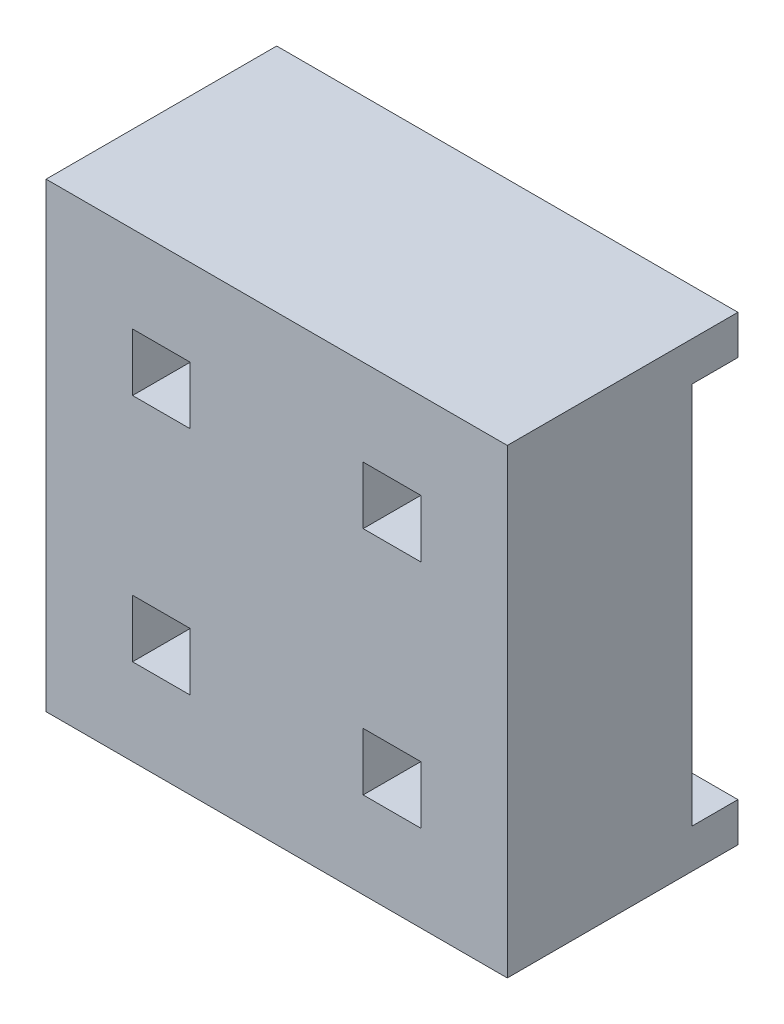
ISO-10303-21;
HEADER;
FILE_DESCRIPTION(('STEP AP214'),'2;1');
FILE_NAME('part.step','',(''),(''),'','','');
FILE_SCHEMA(('AUTOMOTIVE_DESIGN { 1 0 10303 214 1 1 1 1 }'));
ENDSEC;
DATA;
#1=APPLICATION_CONTEXT('core data for automotive mechanical design processes');
#2=APPLICATION_PROTOCOL_DEFINITION('international standard','automotive_design',2000,#1);
#3=PRODUCT_CONTEXT('',#1,'mechanical');
#4=PRODUCT('Part','Part','',(#3));
#5=PRODUCT_RELATED_PRODUCT_CATEGORY('part','',(#4));
#6=PRODUCT_DEFINITION_FORMATION('','',#4);
#7=PRODUCT_DEFINITION_CONTEXT('part definition',#1,'design');
#8=PRODUCT_DEFINITION('design','',#6,#7);
#9=PRODUCT_DEFINITION_SHAPE('','',#8);
#10=(LENGTH_UNIT() NAMED_UNIT(*) SI_UNIT(.MILLI.,.METRE.));
#11=(NAMED_UNIT(*) PLANE_ANGLE_UNIT() SI_UNIT($,.RADIAN.));
#12=(NAMED_UNIT(*) SI_UNIT($,.STERADIAN.) SOLID_ANGLE_UNIT());
#13=UNCERTAINTY_MEASURE_WITH_UNIT(LENGTH_MEASURE(1.E-05),#10,'distance_accuracy_value','');
#14=(GEOMETRIC_REPRESENTATION_CONTEXT(3) GLOBAL_UNCERTAINTY_ASSIGNED_CONTEXT((#13)) GLOBAL_UNIT_ASSIGNED_CONTEXT((#10,
#11,#12)) REPRESENTATION_CONTEXT('',''));
#15=CARTESIAN_POINT('',(0.,0.,0.));
#16=DIRECTION('',(0.,0.,1.));
#17=DIRECTION('',(1.,0.,0.));
#18=AXIS2_PLACEMENT_3D('',#15,#16,#17);
#19=CARTESIAN_POINT('',(0.000117822266474832,0.000124023441458121,1.25));
#20=DIRECTION('',(0.,-4.37113882867379E-08,1.));
#21=DIRECTION('',(0.,-1.,-4.37113882867379E-08));
#22=AXIS2_PLACEMENT_3D('',#19,#20,#21);
#23=PLANE('',#22);
#24=DIRECTION('',(0.,-0.999999999999999,-4.37113882735736E-08));
#25=VECTOR('',#24,1.);
#26=CARTESIAN_POINT('',(-2.53988217773352,-2.10807597655854,1.24999990784765));
#27=LINE('',#26,#25);
#28=CARTESIAN_POINT('',(-2.53988217773353,-2.10807597655854,1.24999990784765));
#29=VERTEX_POINT('',#28);
#30=CARTESIAN_POINT('',(-2.53988217773353,-2.53987597655854,1.24999988897307));
#31=VERTEX_POINT('',#30);
#32=EDGE_CURVE('E11',#29,#31,#27,.T.);
#33=ORIENTED_EDGE('',*,*,#32,.F.);
#34=DIRECTION('',(1.,0.,0.));
#35=VECTOR('',#34,1.);
#36=CARTESIAN_POINT('',(-2.53988217773353,-2.10807597655854,1.24999990784765));
#37=LINE('',#36,#35);
#38=CARTESIAN_POINT('',(2.54011782226648,-2.10807597655854,1.24999990784765));
#39=VERTEX_POINT('',#38);
#40=EDGE_CURVE('E323',#29,#39,#37,.T.);
#41=ORIENTED_EDGE('',*,*,#40,.T.);
#42=DIRECTION('',(0.,0.999999999999999,4.37113882735736E-08));
#43=VECTOR('',#42,1.);
#44=CARTESIAN_POINT('',(2.54011782226648,-2.53987597655854,1.24999988897307));
#45=LINE('',#44,#43);
#46=CARTESIAN_POINT('',(2.54011782226648,-2.53987597655854,1.24999988897307));
#47=VERTEX_POINT('',#46);
#48=EDGE_CURVE('E316',#47,#39,#45,.T.);
#49=ORIENTED_EDGE('',*,*,#48,.F.);
#50=DIRECTION('',(1.,0.,0.));
#51=VECTOR('',#50,1.);
#52=CARTESIAN_POINT('',(-2.53988217773353,-2.53987597655854,1.24999988897307));
#53=LINE('',#52,#51);
#54=EDGE_CURVE('E321',#31,#47,#53,.T.);
#55=ORIENTED_EDGE('',*,*,#54,.F.);
#56=EDGE_LOOP('',(#33,#41,#49,#55));
#57=FACE_BOUND('',#56,.T.);
#58=ADVANCED_FACE('F17',(#57),#23,.F.);
#59=CARTESIAN_POINT('',(-2.53988217773353,2.54012391241453,3.79000011102693));
#60=DIRECTION('',(1.,0.,0.));
#61=DIRECTION('',(0.,1.,4.37113882867379E-08));
#62=AXIS2_PLACEMENT_3D('',#59,#60,#61);
#63=PLANE('',#62);
#64=DIRECTION('',(0.,-0.999999999999999,-4.37113883231379E-08));
#65=VECTOR('',#64,1.);
#66=CARTESIAN_POINT('',(-2.53988217773353,2.10832400123607,1.75800009215235));
#67=LINE('',#66,#65);
#68=CARTESIAN_POINT('',(-2.53988217773353,2.10832400123607,1.75800009215235));
#69=VERTEX_POINT('',#68);
#70=CARTESIAN_POINT('',(-2.53988217773353,-2.10807599876393,1.75799990784765));
#71=VERTEX_POINT('',#70);
#72=EDGE_CURVE('E24',#69,#71,#67,.T.);
#73=ORIENTED_EDGE('',*,*,#72,.T.);
#74=DIRECTION('',(0.,4.37113888392268E-08,-0.999999999999999));
#75=VECTOR('',#74,1.);
#76=CARTESIAN_POINT('',(-2.53988217773353,-2.10807599876393,1.75799990784765));
#77=LINE('',#76,#75);
#78=EDGE_CURVE('E319',#71,#29,#77,.T.);
#79=ORIENTED_EDGE('',*,*,#78,.T.);
#80=ORIENTED_EDGE('',*,*,#32,.T.);
#81=DIRECTION('',(0.,4.3711388314712E-08,-0.999999999999999));
#82=VECTOR('',#81,1.);
#83=CARTESIAN_POINT('',(-2.53988217773353,-2.53987608758547,3.78999988897307));
#84=LINE('',#83,#82);
#85=CARTESIAN_POINT('',(-2.53988217773353,-2.53987608758547,3.78999988897307));
#86=VERTEX_POINT('',#85);
#87=EDGE_CURVE('E301',#86,#31,#84,.T.);
#88=ORIENTED_EDGE('',*,*,#87,.F.);
#89=DIRECTION('',(0.,-0.999999999999999,-4.37113884895503E-08));
#90=VECTOR('',#89,1.);
#91=CARTESIAN_POINT('',(-2.53988217773353,2.54012391241453,3.79000011102693));
#92=LINE('',#91,#90);
#93=CARTESIAN_POINT('',(-2.53988217773353,2.54012391241453,3.79000011102693));
#94=VERTEX_POINT('',#93);
#95=EDGE_CURVE('E289',#94,#86,#92,.T.);
#96=ORIENTED_EDGE('',*,*,#95,.F.);
#97=DIRECTION('',(0.,4.3711388314712E-08,-0.999999999999999));
#98=VECTOR('',#97,1.);
#99=CARTESIAN_POINT('',(-2.53988217773353,2.54012391241453,3.79000011102693));
#100=LINE('',#99,#98);
#101=CARTESIAN_POINT('',(-2.53988217773353,2.54012402344146,1.25000011102693));
#102=VERTEX_POINT('',#101);
#103=EDGE_CURVE('E276',#94,#102,#100,.T.);
#104=ORIENTED_EDGE('',*,*,#103,.T.);
#105=DIRECTION('',(0.,-0.999999999999999,-4.37113882735736E-08));
#106=VECTOR('',#105,1.);
#107=CARTESIAN_POINT('',(-2.53988217773353,2.54012402344146,1.25000011102693));
#108=LINE('',#107,#106);
#109=CARTESIAN_POINT('',(-2.53988217773353,2.10832402344146,1.25000009215235));
#110=VERTEX_POINT('',#109);
#111=EDGE_CURVE('E261',#102,#110,#108,.T.);
#112=ORIENTED_EDGE('',*,*,#111,.T.);
#113=DIRECTION('',(0.,-4.37113879650355E-08,0.999999999999999));
#114=VECTOR('',#113,1.);
#115=CARTESIAN_POINT('',(-2.53988217773353,2.10832402344146,1.25000009215235));
#116=LINE('',#115,#114);
#117=EDGE_CURVE('E247',#110,#69,#116,.T.);
#118=ORIENTED_EDGE('',*,*,#117,.T.);
#119=EDGE_LOOP('',(#73,#79,#80,#88,#96,#104,#112,#118));
#120=FACE_BOUND('',#119,.T.);
#121=ADVANCED_FACE('F416',(#120),#63,.F.);
#122=CARTESIAN_POINT('',(-2.53988217773353,-2.53987608758547,3.78999988897307));
#123=DIRECTION('',(0.,1.,4.37113882867379E-08));
#124=DIRECTION('',(-1.,0.,0.));
#125=AXIS2_PLACEMENT_3D('',#122,#123,#124);
#126=PLANE('',#125);
#127=ORIENTED_EDGE('',*,*,#54,.T.);
#128=DIRECTION('',(0.,4.3711388314712E-08,-0.999999999999999));
#129=VECTOR('',#128,1.);
#130=CARTESIAN_POINT('',(2.54011782226648,-2.53987608758547,3.78999988897307));
#131=LINE('',#130,#129);
#132=CARTESIAN_POINT('',(2.54011782226648,-2.53987608758547,3.78999988897307));
#133=VERTEX_POINT('',#132);
#134=EDGE_CURVE('E313',#133,#47,#131,.T.);
#135=ORIENTED_EDGE('',*,*,#134,.F.);
#136=DIRECTION('',(1.,0.,0.));
#137=VECTOR('',#136,1.);
#138=CARTESIAN_POINT('',(-2.53988217773353,-2.53987608758547,3.78999988897307));
#139=LINE('',#138,#137);
#140=EDGE_CURVE('E304',#86,#133,#139,.T.);
#141=ORIENTED_EDGE('',*,*,#140,.F.);
#142=ORIENTED_EDGE('',*,*,#87,.T.);
#143=EDGE_LOOP('',(#127,#135,#141,#142));
#144=FACE_BOUND('',#143,.T.);
#145=ADVANCED_FACE('F420',(#144),#126,.F.);
#146=CARTESIAN_POINT('',(2.54011782226648,-2.53987608758547,3.78999988897307));
#147=DIRECTION('',(-1.,0.,0.));
#148=DIRECTION('',(0.,-1.,-4.37113882867379E-08));
#149=AXIS2_PLACEMENT_3D('',#146,#147,#148);
#150=PLANE('',#149);
#151=ORIENTED_EDGE('',*,*,#48,.T.);
#152=DIRECTION('',(0.,4.37113888392268E-08,-0.999999999999999));
#153=VECTOR('',#152,1.);
#154=CARTESIAN_POINT('',(2.54011782226648,-2.10807599876393,1.75799990784765));
#155=LINE('',#154,#153);
#156=CARTESIAN_POINT('',(2.54011782226648,-2.10807599876393,1.75799990784765));
#157=VERTEX_POINT('',#156);
#158=EDGE_CURVE('E307',#157,#39,#155,.T.);
#159=ORIENTED_EDGE('',*,*,#158,.F.);
#160=DIRECTION('',(0.,-0.999999999999999,-4.37113883231379E-08));
#161=VECTOR('',#160,1.);
#162=CARTESIAN_POINT('',(2.54011782226648,2.10832400123607,1.75800009215235));
#163=LINE('',#162,#161);
#164=CARTESIAN_POINT('',(2.54011782226648,2.10832400123607,1.75800009215235));
#165=VERTEX_POINT('',#164);
#166=EDGE_CURVE('E292',#165,#157,#163,.T.);
#167=ORIENTED_EDGE('',*,*,#166,.F.);
#168=DIRECTION('',(0.,-4.37113879650355E-08,0.999999999999999));
#169=VECTOR('',#168,1.);
#170=CARTESIAN_POINT('',(2.54011782226648,2.10832402344146,1.25000009215235));
#171=LINE('',#170,#169);
#172=CARTESIAN_POINT('',(2.54011782226648,2.10832402344146,1.25000009215235));
#173=VERTEX_POINT('',#172);
#174=EDGE_CURVE('E278',#173,#165,#171,.T.);
#175=ORIENTED_EDGE('',*,*,#174,.F.);
#176=DIRECTION('',(0.,0.999999999999999,4.37113882735736E-08));
#177=VECTOR('',#176,1.);
#178=CARTESIAN_POINT('',(2.54011782226647,2.10832402344146,1.25000009215235));
#179=LINE('',#178,#177);
#180=CARTESIAN_POINT('',(2.54011782226648,2.54012402344146,1.25000011102693));
#181=VERTEX_POINT('',#180);
#182=EDGE_CURVE('E263',#173,#181,#179,.T.);
#183=ORIENTED_EDGE('',*,*,#182,.T.);
#184=DIRECTION('',(0.,4.3711388314712E-08,-0.999999999999999));
#185=VECTOR('',#184,1.);
#186=CARTESIAN_POINT('',(2.54011782226648,2.54012391241453,3.79000011102693));
#187=LINE('',#186,#185);
#188=CARTESIAN_POINT('',(2.54011782226648,2.54012391241453,3.79000011102693));
#189=VERTEX_POINT('',#188);
#190=EDGE_CURVE('E249',#189,#181,#187,.T.);
#191=ORIENTED_EDGE('',*,*,#190,.F.);
#192=DIRECTION('',(0.,0.999999999999999,4.37113881398737E-08));
#193=VECTOR('',#192,1.);
#194=CARTESIAN_POINT('',(2.54011782226648,-2.53987608758547,3.78999988897307));
#195=LINE('',#194,#193);
#196=EDGE_CURVE('E236',#133,#189,#195,.T.);
#197=ORIENTED_EDGE('',*,*,#196,.F.);
#198=ORIENTED_EDGE('',*,*,#134,.T.);
#199=EDGE_LOOP('',(#151,#159,#167,#175,#183,#191,#197,#198));
#200=FACE_BOUND('',#199,.T.);
#201=ADVANCED_FACE('F329',(#200),#150,.F.);
#202=CARTESIAN_POINT('',(0.952617822266475,1.58762391241453,3.79000006939183));
#203=DIRECTION('',(1.,0.,0.));
#204=DIRECTION('',(0.,1.,4.37113882867379E-08));
#205=AXIS2_PLACEMENT_3D('',#202,#203,#204);
#206=PLANE('',#205);
#207=DIRECTION('',(0.,-0.999999999999999,-4.3711388314712E-08));
#208=VECTOR('',#207,1.);
#209=CARTESIAN_POINT('',(0.952617822266475,1.58762400123607,1.75800006939183));
#210=LINE('',#209,#208);
#211=CARTESIAN_POINT('',(0.952617822266475,1.58762400123607,1.75800006939183));
#212=VERTEX_POINT('',#211);
#213=CARTESIAN_POINT('',(0.952617822266475,0.952624001236073,1.7580000416351));
#214=VERTEX_POINT('',#213);
#215=EDGE_CURVE('E310',#212,#214,#210,.T.);
#216=ORIENTED_EDGE('',*,*,#215,.F.);
#217=DIRECTION('',(0.,4.37113884021311E-08,-0.999999999999999));
#218=VECTOR('',#217,1.);
#219=CARTESIAN_POINT('',(0.952617822266475,1.58762391241453,3.79000006939183));
#220=LINE('',#219,#218);
#221=CARTESIAN_POINT('',(0.952617822266475,1.58762391241453,3.79000006939183));
#222=VERTEX_POINT('',#221);
#223=EDGE_CURVE('E295',#222,#212,#220,.T.);
#224=ORIENTED_EDGE('',*,*,#223,.F.);
#225=DIRECTION('',(0.,-0.999999999999999,-4.3711388314712E-08));
#226=VECTOR('',#225,1.);
#227=CARTESIAN_POINT('',(0.952617822266475,1.58762391241453,3.79000006939183));
#228=LINE('',#227,#226);
#229=CARTESIAN_POINT('',(0.952617822266475,0.952623912414532,3.7900000416351));
#230=VERTEX_POINT('',#229);
#231=EDGE_CURVE('E281',#222,#230,#228,.T.);
#232=ORIENTED_EDGE('',*,*,#231,.T.);
#233=DIRECTION('',(0.,4.37113882928572E-08,-0.999999999999999));
#234=VECTOR('',#233,1.);
#235=CARTESIAN_POINT('',(0.952617822266475,0.952623912414532,3.7900000416351));
#236=LINE('',#235,#234);
#237=EDGE_CURVE('E265',#230,#214,#236,.T.);
#238=ORIENTED_EDGE('',*,*,#237,.T.);
#239=EDGE_LOOP('',(#216,#224,#232,#238));
#240=FACE_BOUND('',#239,.T.);
#241=ADVANCED_FACE('F435',(#240),#206,.T.);
#242=CARTESIAN_POINT('',(1.58761782226647,1.58762391241453,3.79000006939183));
#243=DIRECTION('',(0.,-1.,-4.37113882867379E-08));
#244=DIRECTION('',(1.,0.,0.));
#245=AXIS2_PLACEMENT_3D('',#242,#243,#244);
#246=PLANE('',#245);
#247=DIRECTION('',(-1.,0.,0.));
#248=VECTOR('',#247,1.);
#249=CARTESIAN_POINT('',(1.58761782226647,1.58762400123607,1.75800006939183));
#250=LINE('',#249,#248);
#251=CARTESIAN_POINT('',(1.58761782226647,1.58762400123607,1.75800006939183));
#252=VERTEX_POINT('',#251);
#253=EDGE_CURVE('E298',#252,#212,#250,.T.);
#254=ORIENTED_EDGE('',*,*,#253,.F.);
#255=DIRECTION('',(0.,4.37113884021311E-08,-0.999999999999999));
#256=VECTOR('',#255,1.);
#257=CARTESIAN_POINT('',(1.58761782226647,1.58762391241453,3.79000006939183));
#258=LINE('',#257,#256);
#259=CARTESIAN_POINT('',(1.58761782226647,1.58762391241453,3.79000006939183));
#260=VERTEX_POINT('',#259);
#261=EDGE_CURVE('E283',#260,#252,#258,.T.);
#262=ORIENTED_EDGE('',*,*,#261,.F.);
#263=DIRECTION('',(-1.,0.,0.));
#264=VECTOR('',#263,1.);
#265=CARTESIAN_POINT('',(1.58761782226647,1.58762391241453,3.79000006939183));
#266=LINE('',#265,#264);
#267=EDGE_CURVE('E267',#260,#222,#266,.T.);
#268=ORIENTED_EDGE('',*,*,#267,.T.);
#269=ORIENTED_EDGE('',*,*,#223,.T.);
#270=EDGE_LOOP('',(#254,#262,#268,#269));
#271=FACE_BOUND('',#270,.T.);
#272=ADVANCED_FACE('F438',(#271),#246,.T.);
#273=CARTESIAN_POINT('',(1.58761782226647,0.952623912414532,3.7900000416351));
#274=DIRECTION('',(-1.,0.,0.));
#275=DIRECTION('',(0.,-1.,-4.37113882867379E-08));
#276=AXIS2_PLACEMENT_3D('',#273,#274,#275);
#277=PLANE('',#276);
#278=DIRECTION('',(0.,0.999999999999999,4.3711388314712E-08));
#279=VECTOR('',#278,1.);
#280=CARTESIAN_POINT('',(1.58761782226647,0.952624001236073,1.7580000416351));
#281=LINE('',#280,#279);
#282=CARTESIAN_POINT('',(1.58761782226647,0.952624001236073,1.7580000416351));
#283=VERTEX_POINT('',#282);
#284=EDGE_CURVE('E286',#283,#252,#281,.T.);
#285=ORIENTED_EDGE('',*,*,#284,.F.);
#286=DIRECTION('',(0.,4.37113882928572E-08,-0.999999999999999));
#287=VECTOR('',#286,1.);
#288=CARTESIAN_POINT('',(1.58761782226647,0.952623912414532,3.7900000416351));
#289=LINE('',#288,#287);
#290=CARTESIAN_POINT('',(1.58761782226647,0.952623912414532,3.7900000416351));
#291=VERTEX_POINT('',#290);
#292=EDGE_CURVE('E270',#291,#283,#289,.T.);
#293=ORIENTED_EDGE('',*,*,#292,.F.);
#294=DIRECTION('',(0.,0.999999999999999,4.3711388314712E-08));
#295=VECTOR('',#294,1.);
#296=CARTESIAN_POINT('',(1.58761782226647,0.952623912414532,3.7900000416351));
#297=LINE('',#296,#295);
#298=EDGE_CURVE('E252',#291,#260,#297,.T.);
#299=ORIENTED_EDGE('',*,*,#298,.T.);
#300=ORIENTED_EDGE('',*,*,#261,.T.);
#301=EDGE_LOOP('',(#285,#293,#299,#300));
#302=FACE_BOUND('',#301,.T.);
#303=ADVANCED_FACE('F442',(#302),#277,.T.);
#304=CARTESIAN_POINT('',(0.952617822266475,-0.952376087585468,3.7899999583649));
#305=DIRECTION('',(1.,0.,0.));
#306=DIRECTION('',(0.,1.,4.37113882867379E-08));
#307=AXIS2_PLACEMENT_3D('',#304,#305,#306);
#308=PLANE('',#307);
#309=DIRECTION('',(0.,-0.999999999999999,-4.3711388314712E-08));
#310=VECTOR('',#309,1.);
#311=CARTESIAN_POINT('',(0.952617822266475,-0.952375998763927,1.7579999583649));
#312=LINE('',#311,#310);
#313=CARTESIAN_POINT('',(0.952617822266475,-0.952375998763927,1.7579999583649));
#314=VERTEX_POINT('',#313);
#315=CARTESIAN_POINT('',(0.952617822266475,-1.58737599876393,1.75799993060817));
#316=VERTEX_POINT('',#315);
#317=EDGE_CURVE('E273',#314,#316,#312,.T.);
#318=ORIENTED_EDGE('',*,*,#317,.F.);
#319=DIRECTION('',(0.,4.37113882928572E-08,-0.999999999999999));
#320=VECTOR('',#319,1.);
#321=CARTESIAN_POINT('',(0.952617822266475,-0.952376087585468,3.7899999583649));
#322=LINE('',#321,#320);
#323=CARTESIAN_POINT('',(0.952617822266475,-0.952376087585468,3.7899999583649));
#324=VERTEX_POINT('',#323);
#325=EDGE_CURVE('E255',#324,#314,#322,.T.);
#326=ORIENTED_EDGE('',*,*,#325,.F.);
#327=DIRECTION('',(0.,-0.999999999999999,-4.3711388314712E-08));
#328=VECTOR('',#327,1.);
#329=CARTESIAN_POINT('',(0.952617822266475,-0.952376087585468,3.7899999583649));
#330=LINE('',#329,#328);
#331=CARTESIAN_POINT('',(0.952617822266475,-1.58737608758547,3.78999993060817));
#332=VERTEX_POINT('',#331);
#333=EDGE_CURVE('E239',#324,#332,#330,.T.);
#334=ORIENTED_EDGE('',*,*,#333,.T.);
#335=DIRECTION('',(0.,4.37113881835833E-08,-0.999999999999999));
#336=VECTOR('',#335,1.);
#337=CARTESIAN_POINT('',(0.952617822266475,-1.58737608758547,3.78999993060817));
#338=LINE('',#337,#336);
#339=EDGE_CURVE('E225',#332,#316,#338,.T.);
#340=ORIENTED_EDGE('',*,*,#339,.T.);
#341=EDGE_LOOP('',(#318,#326,#334,#340));
#342=FACE_BOUND('',#341,.T.);
#343=ADVANCED_FACE('F450',(#342),#308,.T.);
#344=CARTESIAN_POINT('',(1.58761782226647,-0.952376087585468,3.7899999583649));
#345=DIRECTION('',(0.,-1.,-4.37113882867379E-08));
#346=DIRECTION('',(1.,0.,0.));
#347=AXIS2_PLACEMENT_3D('',#344,#345,#346);
#348=PLANE('',#347);
#349=DIRECTION('',(-1.,0.,0.));
#350=VECTOR('',#349,1.);
#351=CARTESIAN_POINT('',(1.58761782226647,-0.952375998763927,1.7579999583649));
#352=LINE('',#351,#350);
#353=CARTESIAN_POINT('',(1.58761782226647,-0.952375998763927,1.7579999583649));
#354=VERTEX_POINT('',#353);
#355=EDGE_CURVE('E258',#354,#314,#352,.T.);
#356=ORIENTED_EDGE('',*,*,#355,.F.);
#357=DIRECTION('',(0.,4.37113882928572E-08,-0.999999999999999));
#358=VECTOR('',#357,1.);
#359=CARTESIAN_POINT('',(1.58761782226647,-0.952376087585468,3.7899999583649));
#360=LINE('',#359,#358);
#361=CARTESIAN_POINT('',(1.58761782226647,-0.952376087585468,3.7899999583649));
#362=VERTEX_POINT('',#361);
#363=EDGE_CURVE('E241',#362,#354,#360,.T.);
#364=ORIENTED_EDGE('',*,*,#363,.F.);
#365=DIRECTION('',(-1.,0.,0.));
#366=VECTOR('',#365,1.);
#367=CARTESIAN_POINT('',(1.58761782226647,-0.952376087585468,3.7899999583649));
#368=LINE('',#367,#366);
#369=EDGE_CURVE('E227',#362,#324,#368,.T.);
#370=ORIENTED_EDGE('',*,*,#369,.T.);
#371=ORIENTED_EDGE('',*,*,#325,.T.);
#372=EDGE_LOOP('',(#356,#364,#370,#371));
#373=FACE_BOUND('',#372,.T.);
#374=ADVANCED_FACE('F454',(#373),#348,.T.);
#375=CARTESIAN_POINT('',(1.58761782226647,-1.58737608758547,3.78999993060817));
#376=DIRECTION('',(-1.,0.,0.));
#377=DIRECTION('',(0.,-1.,-4.37113882867379E-08));
#378=AXIS2_PLACEMENT_3D('',#375,#376,#377);
#379=PLANE('',#378);
#380=DIRECTION('',(0.,0.999999999999999,4.3711388314712E-08));
#381=VECTOR('',#380,1.);
#382=CARTESIAN_POINT('',(1.58761782226647,-1.58737599876393,1.75799993060817));
#383=LINE('',#382,#381);
#384=CARTESIAN_POINT('',(1.58761782226647,-1.58737599876393,1.75799993060817));
#385=VERTEX_POINT('',#384);
#386=EDGE_CURVE('E244',#385,#354,#383,.T.);
#387=ORIENTED_EDGE('',*,*,#386,.F.);
#388=DIRECTION('',(0.,4.37113881835833E-08,-0.999999999999999));
#389=VECTOR('',#388,1.);
#390=CARTESIAN_POINT('',(1.58761782226647,-1.58737608758547,3.78999993060817));
#391=LINE('',#390,#389);
#392=CARTESIAN_POINT('',(1.58761782226647,-1.58737608758547,3.78999993060817));
#393=VERTEX_POINT('',#392);
#394=EDGE_CURVE('E230',#393,#385,#391,.T.);
#395=ORIENTED_EDGE('',*,*,#394,.F.);
#396=DIRECTION('',(0.,0.999999999999999,4.3711388314712E-08));
#397=VECTOR('',#396,1.);
#398=CARTESIAN_POINT('',(1.58761782226647,-1.58737608758547,3.78999993060817));
#399=LINE('',#398,#397);
#400=EDGE_CURVE('E216',#393,#362,#399,.T.);
#401=ORIENTED_EDGE('',*,*,#400,.T.);
#402=ORIENTED_EDGE('',*,*,#363,.T.);
#403=EDGE_LOOP('',(#387,#395,#401,#402));
#404=FACE_BOUND('',#403,.T.);
#405=ADVANCED_FACE('F464',(#404),#379,.T.);
#406=CARTESIAN_POINT('',(-1.58738217773353,1.58762391241453,3.79000006939183));
#407=DIRECTION('',(1.,0.,0.));
#408=DIRECTION('',(0.,1.,4.37113882867379E-08));
#409=AXIS2_PLACEMENT_3D('',#406,#407,#408);
#410=PLANE('',#409);
#411=DIRECTION('',(0.,-0.999999999999999,-4.3711388314712E-08));
#412=VECTOR('',#411,1.);
#413=CARTESIAN_POINT('',(-1.58738217773353,1.58762400123607,1.75800006939183));
#414=LINE('',#413,#412);
#415=CARTESIAN_POINT('',(-1.58738217773353,1.58762400123607,1.75800006939183));
#416=VERTEX_POINT('',#415);
#417=CARTESIAN_POINT('',(-1.58738217773353,0.952624001236073,1.7580000416351));
#418=VERTEX_POINT('',#417);
#419=EDGE_CURVE('E233',#416,#418,#414,.T.);
#420=ORIENTED_EDGE('',*,*,#419,.F.);
#421=DIRECTION('',(0.,4.37113884021311E-08,-0.999999999999999));
#422=VECTOR('',#421,1.);
#423=CARTESIAN_POINT('',(-1.58738217773353,1.58762391241453,3.79000006939183));
#424=LINE('',#423,#422);
#425=CARTESIAN_POINT('',(-1.58738217773353,1.58762391241453,3.79000006939183));
#426=VERTEX_POINT('',#425);
#427=EDGE_CURVE('E219',#426,#416,#424,.T.);
#428=ORIENTED_EDGE('',*,*,#427,.F.);
#429=DIRECTION('',(0.,-0.999999999999999,-4.3711388314712E-08));
#430=VECTOR('',#429,1.);
#431=CARTESIAN_POINT('',(-1.58738217773353,1.58762391241453,3.79000006939183));
#432=LINE('',#431,#430);
#433=CARTESIAN_POINT('',(-1.58738217773353,0.952623912414532,3.7900000416351));
#434=VERTEX_POINT('',#433);
#435=EDGE_CURVE('E201',#426,#434,#432,.T.);
#436=ORIENTED_EDGE('',*,*,#435,.T.);
#437=DIRECTION('',(0.,4.37113882928572E-08,-0.999999999999999));
#438=VECTOR('',#437,1.);
#439=CARTESIAN_POINT('',(-1.58738217773353,0.952623912414532,3.7900000416351));
#440=LINE('',#439,#438);
#441=EDGE_CURVE('E384',#434,#418,#440,.T.);
#442=ORIENTED_EDGE('',*,*,#441,.T.);
#443=EDGE_LOOP('',(#420,#428,#436,#442));
#444=FACE_BOUND('',#443,.T.);
#445=ADVANCED_FACE('F397',(#444),#410,.T.);
#446=CARTESIAN_POINT('',(-0.952382177733525,1.58762391241453,3.79000006939183));
#447=DIRECTION('',(0.,-1.,-4.37113882867379E-08));
#448=DIRECTION('',(1.,0.,0.));
#449=AXIS2_PLACEMENT_3D('',#446,#447,#448);
#450=PLANE('',#449);
#451=DIRECTION('',(-1.,0.,0.));
#452=VECTOR('',#451,1.);
#453=CARTESIAN_POINT('',(-0.952382177733525,1.58762400123607,1.75800006939183));
#454=LINE('',#453,#452);
#455=CARTESIAN_POINT('',(-0.952382177733525,1.58762400123607,1.75800006939183));
#456=VERTEX_POINT('',#455);
#457=EDGE_CURVE('E222',#456,#416,#454,.T.);
#458=ORIENTED_EDGE('',*,*,#457,.F.);
#459=DIRECTION('',(0.,4.37113884021311E-08,-0.999999999999999));
#460=VECTOR('',#459,1.);
#461=CARTESIAN_POINT('',(-0.952382177733525,1.58762391241453,3.79000006939183));
#462=LINE('',#461,#460);
#463=CARTESIAN_POINT('',(-0.952382177733525,1.58762391241453,3.79000006939183));
#464=VERTEX_POINT('',#463);
#465=EDGE_CURVE('E204',#464,#456,#462,.T.);
#466=ORIENTED_EDGE('',*,*,#465,.F.);
#467=DIRECTION('',(-1.,0.,0.));
#468=VECTOR('',#467,1.);
#469=CARTESIAN_POINT('',(-0.952382177733525,1.58762391241453,3.79000006939183));
#470=LINE('',#469,#468);
#471=EDGE_CURVE('E207',#464,#426,#470,.T.);
#472=ORIENTED_EDGE('',*,*,#471,.T.);
#473=ORIENTED_EDGE('',*,*,#427,.T.);
#474=EDGE_LOOP('',(#458,#466,#472,#473));
#475=FACE_BOUND('',#474,.T.);
#476=ADVANCED_FACE('F389',(#475),#450,.T.);
#477=CARTESIAN_POINT('',(-0.952382177733525,0.952623912414532,3.7900000416351));
#478=DIRECTION('',(-1.,0.,0.));
#479=DIRECTION('',(0.,-1.,-4.37113882867379E-08));
#480=AXIS2_PLACEMENT_3D('',#477,#478,#479);
#481=PLANE('',#480);
#482=DIRECTION('',(0.,0.999999999999999,4.3711388314712E-08));
#483=VECTOR('',#482,1.);
#484=CARTESIAN_POINT('',(-0.952382177733525,0.952624001236073,1.7580000416351));
#485=LINE('',#484,#483);
#486=CARTESIAN_POINT('',(-0.952382177733525,0.952624001236073,1.7580000416351));
#487=VERTEX_POINT('',#486);
#488=EDGE_CURVE('E213',#487,#456,#485,.T.);
#489=ORIENTED_EDGE('',*,*,#488,.F.);
#490=DIRECTION('',(0.,4.37113882928572E-08,-0.999999999999999));
#491=VECTOR('',#490,1.);
#492=CARTESIAN_POINT('',(-0.952382177733525,0.952623912414532,3.7900000416351));
#493=LINE('',#492,#491);
#494=CARTESIAN_POINT('',(-0.952382177733525,0.952623912414532,3.7900000416351));
#495=VERTEX_POINT('',#494);
#496=EDGE_CURVE('E202',#495,#487,#493,.T.);
#497=ORIENTED_EDGE('',*,*,#496,.F.);
#498=DIRECTION('',(0.,0.999999999999999,4.3711388314712E-08));
#499=VECTOR('',#498,1.);
#500=CARTESIAN_POINT('',(-0.952382177733525,0.952623912414532,3.7900000416351));
#501=LINE('',#500,#499);
#502=EDGE_CURVE('E378',#495,#464,#501,.T.);
#503=ORIENTED_EDGE('',*,*,#502,.T.);
#504=ORIENTED_EDGE('',*,*,#465,.T.);
#505=EDGE_LOOP('',(#489,#497,#503,#504));
#506=FACE_BOUND('',#505,.T.);
#507=ADVANCED_FACE('F403',(#506),#481,.T.);
#508=CARTESIAN_POINT('',(-1.58738217773353,-0.952376087585468,3.7899999583649));
#509=DIRECTION('',(1.,0.,0.));
#510=DIRECTION('',(0.,1.,4.37113882867379E-08));
#511=AXIS2_PLACEMENT_3D('',#508,#509,#510);
#512=PLANE('',#511);
#513=DIRECTION('',(0.,-0.999999999999999,-4.3711388314712E-08));
#514=VECTOR('',#513,1.);
#515=CARTESIAN_POINT('',(-1.58738217773353,-0.952375998763927,1.7579999583649));
#516=LINE('',#515,#514);
#517=CARTESIAN_POINT('',(-1.58738217773353,-0.952375998763927,1.7579999583649));
#518=VERTEX_POINT('',#517);
#519=CARTESIAN_POINT('',(-1.58738217773353,-1.58737599876393,1.75799993060817));
#520=VERTEX_POINT('',#519);
#521=EDGE_CURVE('E177',#518,#520,#516,.T.);
#522=ORIENTED_EDGE('',*,*,#521,.F.);
#523=DIRECTION('',(0.,4.37113882928572E-08,-0.999999999999999));
#524=VECTOR('',#523,1.);
#525=CARTESIAN_POINT('',(-1.58738217773353,-0.952376087585468,3.7899999583649));
#526=LINE('',#525,#524);
#527=CARTESIAN_POINT('',(-1.58738217773353,-0.952376087585468,3.7899999583649));
#528=VERTEX_POINT('',#527);
#529=EDGE_CURVE('E381',#528,#518,#526,.T.);
#530=ORIENTED_EDGE('',*,*,#529,.F.);
#531=DIRECTION('',(0.,-0.999999999999999,-4.3711388314712E-08));
#532=VECTOR('',#531,1.);
#533=CARTESIAN_POINT('',(-1.58738217773353,-0.952376087585468,3.7899999583649));
#534=LINE('',#533,#532);
#535=CARTESIAN_POINT('',(-1.58738217773353,-1.58737608758547,3.78999993060817));
#536=VERTEX_POINT('',#535);
#537=EDGE_CURVE('E180',#528,#536,#534,.T.);
#538=ORIENTED_EDGE('',*,*,#537,.T.);
#539=DIRECTION('',(0.,4.37113881835833E-08,-0.999999999999999));
#540=VECTOR('',#539,1.);
#541=CARTESIAN_POINT('',(-1.58738217773353,-1.58737608758547,3.78999993060817));
#542=LINE('',#541,#540);
#543=EDGE_CURVE('E173',#536,#520,#542,.T.);
#544=ORIENTED_EDGE('',*,*,#543,.T.);
#545=EDGE_LOOP('',(#522,#530,#538,#544));
#546=FACE_BOUND('',#545,.T.);
#547=ADVANCED_FACE('F175',(#546),#512,.T.);
#548=CARTESIAN_POINT('',(-0.952382177733525,-0.952376087585468,3.7899999583649));
#549=DIRECTION('',(0.,-1.,-4.37113882867379E-08));
#550=DIRECTION('',(1.,0.,0.));
#551=AXIS2_PLACEMENT_3D('',#548,#549,#550);
#552=PLANE('',#551);
#553=DIRECTION('',(-1.,0.,0.));
#554=VECTOR('',#553,1.);
#555=CARTESIAN_POINT('',(-0.952382177733525,-0.952375998763927,1.7579999583649));
#556=LINE('',#555,#554);
#557=CARTESIAN_POINT('',(-0.952382177733525,-0.952375998763927,1.7579999583649));
#558=VERTEX_POINT('',#557);
#559=EDGE_CURVE('E200',#558,#518,#556,.T.);
#560=ORIENTED_EDGE('',*,*,#559,.F.);
#561=DIRECTION('',(0.,4.37113882928572E-08,-0.999999999999999));
#562=VECTOR('',#561,1.);
#563=CARTESIAN_POINT('',(-0.952382177733525,-0.952376087585468,3.7899999583649));
#564=LINE('',#563,#562);
#565=CARTESIAN_POINT('',(-0.952382177733525,-0.952376087585468,3.7899999583649));
#566=VERTEX_POINT('',#565);
#567=EDGE_CURVE('E373',#566,#558,#564,.T.);
#568=ORIENTED_EDGE('',*,*,#567,.F.);
#569=DIRECTION('',(-1.,0.,0.));
#570=VECTOR('',#569,1.);
#571=CARTESIAN_POINT('',(-0.952382177733525,-0.952376087585468,3.7899999583649));
#572=LINE('',#571,#570);
#573=EDGE_CURVE('E184',#566,#528,#572,.T.);
#574=ORIENTED_EDGE('',*,*,#573,.T.);
#575=ORIENTED_EDGE('',*,*,#529,.T.);
#576=EDGE_LOOP('',(#560,#568,#574,#575));
#577=FACE_BOUND('',#576,.T.);
#578=ADVANCED_FACE('F411',(#577),#552,.T.);
#579=CARTESIAN_POINT('',(-0.952382177733525,-1.58737608758547,3.78999993060817));
#580=DIRECTION('',(-1.,0.,0.));
#581=DIRECTION('',(0.,-1.,-4.37113882867379E-08));
#582=AXIS2_PLACEMENT_3D('',#579,#580,#581);
#583=PLANE('',#582);
#584=DIRECTION('',(0.,0.999999999999999,4.3711388314712E-08));
#585=VECTOR('',#584,1.);
#586=CARTESIAN_POINT('',(-0.952382177733525,-1.58737599876393,1.75799993060817));
#587=LINE('',#586,#585);
#588=CARTESIAN_POINT('',(-0.952382177733525,-1.58737599876393,1.75799993060817));
#589=VERTEX_POINT('',#588);
#590=EDGE_CURVE('E376',#589,#558,#587,.T.);
#591=ORIENTED_EDGE('',*,*,#590,.F.);
#592=DIRECTION('',(0.,4.37113881835833E-08,-0.999999999999999));
#593=VECTOR('',#592,1.);
#594=CARTESIAN_POINT('',(-0.952382177733525,-1.58737608758547,3.78999993060817));
#595=LINE('',#594,#593);
#596=CARTESIAN_POINT('',(-0.952382177733525,-1.58737608758547,3.78999993060817));
#597=VERTEX_POINT('',#596);
#598=EDGE_CURVE('E191',#597,#589,#595,.T.);
#599=ORIENTED_EDGE('',*,*,#598,.F.);
#600=DIRECTION('',(0.,0.999999999999999,4.3711388314712E-08));
#601=VECTOR('',#600,1.);
#602=CARTESIAN_POINT('',(-0.952382177733525,-1.58737608758547,3.78999993060817));
#603=LINE('',#602,#601);
#604=EDGE_CURVE('E361',#597,#566,#603,.T.);
#605=ORIENTED_EDGE('',*,*,#604,.T.);
#606=ORIENTED_EDGE('',*,*,#567,.T.);
#607=EDGE_LOOP('',(#591,#599,#605,#606));
#608=FACE_BOUND('',#607,.T.);
#609=ADVANCED_FACE('F470',(#608),#583,.T.);
#610=CARTESIAN_POINT('',(0.952617822266475,0.952623912414532,3.7900000416351));
#611=DIRECTION('',(0.,1.,4.37113882867379E-08));
#612=DIRECTION('',(-1.,0.,0.));
#613=AXIS2_PLACEMENT_3D('',#610,#611,#612);
#614=PLANE('',#613);
#615=DIRECTION('',(1.,0.,0.));
#616=VECTOR('',#615,1.);
#617=CARTESIAN_POINT('',(0.952617822266475,0.952624001236073,1.7580000416351));
#618=LINE('',#617,#616);
#619=EDGE_CURVE('E369',#214,#283,#618,.T.);
#620=ORIENTED_EDGE('',*,*,#619,.F.);
#621=ORIENTED_EDGE('',*,*,#237,.F.);
#622=DIRECTION('',(1.,0.,0.));
#623=VECTOR('',#622,1.);
#624=CARTESIAN_POINT('',(0.952617822266475,0.952623912414532,3.7900000416351));
#625=LINE('',#624,#623);
#626=EDGE_CURVE('E194',#230,#291,#625,.T.);
#627=ORIENTED_EDGE('',*,*,#626,.T.);
#628=ORIENTED_EDGE('',*,*,#292,.T.);
#629=EDGE_LOOP('',(#620,#621,#627,#628));
#630=FACE_BOUND('',#629,.T.);
#631=ADVANCED_FACE('F466',(#630),#614,.T.);
#632=CARTESIAN_POINT('',(0.952617822266475,-1.58737608758547,3.78999993060817));
#633=DIRECTION('',(0.,1.,4.37113882867379E-08));
#634=DIRECTION('',(-1.,0.,0.));
#635=AXIS2_PLACEMENT_3D('',#632,#633,#634);
#636=PLANE('',#635);
#637=DIRECTION('',(1.,0.,0.));
#638=VECTOR('',#637,1.);
#639=CARTESIAN_POINT('',(0.952617822266475,-1.58737599876393,1.75799993060817));
#640=LINE('',#639,#638);
#641=EDGE_CURVE('E185',#316,#385,#640,.T.);
#642=ORIENTED_EDGE('',*,*,#641,.F.);
#643=ORIENTED_EDGE('',*,*,#339,.F.);
#644=DIRECTION('',(1.,0.,0.));
#645=VECTOR('',#644,1.);
#646=CARTESIAN_POINT('',(0.952617822266475,-1.58737608758547,3.78999993060817));
#647=LINE('',#646,#645);
#648=EDGE_CURVE('E195',#332,#393,#647,.T.);
#649=ORIENTED_EDGE('',*,*,#648,.T.);
#650=ORIENTED_EDGE('',*,*,#394,.T.);
#651=EDGE_LOOP('',(#642,#643,#649,#650));
#652=FACE_BOUND('',#651,.T.);
#653=ADVANCED_FACE('F469',(#652),#636,.T.);
#654=CARTESIAN_POINT('',(-1.58738217773353,0.952623912414532,3.7900000416351));
#655=DIRECTION('',(0.,1.,4.37113882867379E-08));
#656=DIRECTION('',(-1.,0.,0.));
#657=AXIS2_PLACEMENT_3D('',#654,#655,#656);
#658=PLANE('',#657);
#659=DIRECTION('',(1.,0.,0.));
#660=VECTOR('',#659,1.);
#661=CARTESIAN_POINT('',(-1.58738217773353,0.952624001236073,1.7580000416351));
#662=LINE('',#661,#660);
#663=EDGE_CURVE('E358',#418,#487,#662,.T.);
#664=ORIENTED_EDGE('',*,*,#663,.F.);
#665=ORIENTED_EDGE('',*,*,#441,.F.);
#666=DIRECTION('',(1.,0.,0.));
#667=VECTOR('',#666,1.);
#668=CARTESIAN_POINT('',(-1.58738217773353,0.952623912414532,3.7900000416351));
#669=LINE('',#668,#667);
#670=EDGE_CURVE('E348',#434,#495,#669,.T.);
#671=ORIENTED_EDGE('',*,*,#670,.T.);
#672=ORIENTED_EDGE('',*,*,#496,.T.);
#673=EDGE_LOOP('',(#664,#665,#671,#672));
#674=FACE_BOUND('',#673,.T.);
#675=ADVANCED_FACE('F400',(#674),#658,.T.);
#676=CARTESIAN_POINT('',(-1.58738217773353,-1.58737608758547,3.78999993060817));
#677=DIRECTION('',(0.,1.,4.37113882867379E-08));
#678=DIRECTION('',(-1.,0.,0.));
#679=AXIS2_PLACEMENT_3D('',#676,#677,#678);
#680=PLANE('',#679);
#681=DIRECTION('',(1.,0.,0.));
#682=VECTOR('',#681,1.);
#683=CARTESIAN_POINT('',(-1.58738217773353,-1.58737599876393,1.75799993060817));
#684=LINE('',#683,#682);
#685=EDGE_CURVE('E189',#520,#589,#684,.T.);
#686=ORIENTED_EDGE('',*,*,#685,.F.);
#687=ORIENTED_EDGE('',*,*,#543,.F.);
#688=DIRECTION('',(1.,0.,0.));
#689=VECTOR('',#688,1.);
#690=CARTESIAN_POINT('',(-1.58738217773353,-1.58737608758547,3.78999993060817));
#691=LINE('',#690,#689);
#692=EDGE_CURVE('E346',#536,#597,#691,.T.);
#693=ORIENTED_EDGE('',*,*,#692,.T.);
#694=ORIENTED_EDGE('',*,*,#598,.T.);
#695=EDGE_LOOP('',(#686,#687,#693,#694));
#696=FACE_BOUND('',#695,.T.);
#697=ADVANCED_FACE('F190',(#696),#680,.T.);
#698=CARTESIAN_POINT('',(2.54011782226648,2.54012391241453,3.79000011102693));
#699=DIRECTION('',(0.,-1.,-4.37113882867379E-08));
#700=DIRECTION('',(1.,0.,0.));
#701=AXIS2_PLACEMENT_3D('',#698,#699,#700);
#702=PLANE('',#701);
#703=DIRECTION('',(-1.,0.,0.));
#704=VECTOR('',#703,1.);
#705=CARTESIAN_POINT('',(2.54011782226648,2.54012402344146,1.25000011102693));
#706=LINE('',#705,#704);
#707=EDGE_CURVE('E351',#181,#102,#706,.T.);
#708=ORIENTED_EDGE('',*,*,#707,.T.);
#709=ORIENTED_EDGE('',*,*,#103,.F.);
#710=DIRECTION('',(-1.,0.,0.));
#711=VECTOR('',#710,1.);
#712=CARTESIAN_POINT('',(2.54011782226648,2.54012391241453,3.79000011102693));
#713=LINE('',#712,#711);
#714=EDGE_CURVE('E339',#189,#94,#713,.T.);
#715=ORIENTED_EDGE('',*,*,#714,.F.);
#716=ORIENTED_EDGE('',*,*,#190,.T.);
#717=EDGE_LOOP('',(#708,#709,#715,#716));
#718=FACE_BOUND('',#717,.T.);
#719=ADVANCED_FACE('F446',(#718),#702,.F.);
#720=CARTESIAN_POINT('',(0.000117822266474832,0.000123912414531873,3.79));
#721=DIRECTION('',(0.,-4.37113882867379E-08,1.));
#722=DIRECTION('',(0.,-1.,-4.37113882867379E-08));
#723=AXIS2_PLACEMENT_3D('',#720,#721,#722);
#724=PLANE('',#723);
#725=ORIENTED_EDGE('',*,*,#95,.T.);
#726=ORIENTED_EDGE('',*,*,#140,.T.);
#727=ORIENTED_EDGE('',*,*,#196,.T.);
#728=ORIENTED_EDGE('',*,*,#714,.T.);
#729=EDGE_LOOP('',(#725,#726,#727,#728));
#730=FACE_BOUND('',#729,.T.);
#731=ORIENTED_EDGE('',*,*,#435,.F.);
#732=ORIENTED_EDGE('',*,*,#471,.F.);
#733=ORIENTED_EDGE('',*,*,#502,.F.);
#734=ORIENTED_EDGE('',*,*,#670,.F.);
#735=EDGE_LOOP('',(#731,#732,#733,#734));
#736=FACE_BOUND('',#735,.T.);
#737=ORIENTED_EDGE('',*,*,#333,.F.);
#738=ORIENTED_EDGE('',*,*,#369,.F.);
#739=ORIENTED_EDGE('',*,*,#400,.F.);
#740=ORIENTED_EDGE('',*,*,#648,.F.);
#741=EDGE_LOOP('',(#737,#738,#739,#740));
#742=FACE_BOUND('',#741,.T.);
#743=ORIENTED_EDGE('',*,*,#231,.F.);
#744=ORIENTED_EDGE('',*,*,#267,.F.);
#745=ORIENTED_EDGE('',*,*,#298,.F.);
#746=ORIENTED_EDGE('',*,*,#626,.F.);
#747=EDGE_LOOP('',(#743,#744,#745,#746));
#748=FACE_BOUND('',#747,.T.);
#749=ORIENTED_EDGE('',*,*,#537,.F.);
#750=ORIENTED_EDGE('',*,*,#573,.F.);
#751=ORIENTED_EDGE('',*,*,#604,.F.);
#752=ORIENTED_EDGE('',*,*,#692,.F.);
#753=EDGE_LOOP('',(#749,#750,#751,#752));
#754=FACE_BOUND('',#753,.T.);
#755=ADVANCED_FACE('F393',(#730,#736,#742,#748,#754),#724,.T.);
#756=CARTESIAN_POINT('',(0.000117822266474832,0.000124023441458121,1.25));
#757=DIRECTION('',(0.,-4.37113882867379E-08,1.));
#758=DIRECTION('',(0.,-1.,-4.37113882867379E-08));
#759=AXIS2_PLACEMENT_3D('',#756,#757,#758);
#760=PLANE('',#759);
#761=ORIENTED_EDGE('',*,*,#182,.F.);
#762=DIRECTION('',(1.,0.,0.));
#763=VECTOR('',#762,1.);
#764=CARTESIAN_POINT('',(-2.53988217773353,2.10832402344146,1.25000009215235));
#765=LINE('',#764,#763);
#766=EDGE_CURVE('E335',#110,#173,#765,.T.);
#767=ORIENTED_EDGE('',*,*,#766,.F.);
#768=ORIENTED_EDGE('',*,*,#111,.F.);
#769=ORIENTED_EDGE('',*,*,#707,.F.);
#770=EDGE_LOOP('',(#761,#767,#768,#769));
#771=FACE_BOUND('',#770,.T.);
#772=ADVANCED_FACE('F429',(#771),#760,.F.);
#773=CARTESIAN_POINT('',(-2.53988217773353,2.10832400123607,1.75800009215235));
#774=DIRECTION('',(0.,-4.37113882867379E-08,1.));
#775=DIRECTION('',(0.,-1.,-4.37113882867379E-08));
#776=AXIS2_PLACEMENT_3D('',#773,#774,#775);
#777=PLANE('',#776);
#778=ORIENTED_EDGE('',*,*,#166,.T.);
#779=DIRECTION('',(1.,0.,0.));
#780=VECTOR('',#779,1.);
#781=CARTESIAN_POINT('',(-2.53988217773353,-2.10807599876393,1.75799990784765));
#782=LINE('',#781,#780);
#783=EDGE_CURVE('E333',#71,#157,#782,.T.);
#784=ORIENTED_EDGE('',*,*,#783,.F.);
#785=ORIENTED_EDGE('',*,*,#72,.F.);
#786=DIRECTION('',(1.,0.,0.));
#787=VECTOR('',#786,1.);
#788=CARTESIAN_POINT('',(-2.53988217773353,2.10832400123607,1.75800009215235));
#789=LINE('',#788,#787);
#790=EDGE_CURVE('E336',#69,#165,#789,.T.);
#791=ORIENTED_EDGE('',*,*,#790,.T.);
#792=EDGE_LOOP('',(#778,#784,#785,#791));
#793=FACE_BOUND('',#792,.T.);
#794=ORIENTED_EDGE('',*,*,#317,.T.);
#795=ORIENTED_EDGE('',*,*,#641,.T.);
#796=ORIENTED_EDGE('',*,*,#386,.T.);
#797=ORIENTED_EDGE('',*,*,#355,.T.);
#798=EDGE_LOOP('',(#794,#795,#796,#797));
#799=FACE_BOUND('',#798,.T.);
#800=ORIENTED_EDGE('',*,*,#419,.T.);
#801=ORIENTED_EDGE('',*,*,#663,.T.);
#802=ORIENTED_EDGE('',*,*,#488,.T.);
#803=ORIENTED_EDGE('',*,*,#457,.T.);
#804=EDGE_LOOP('',(#800,#801,#802,#803));
#805=FACE_BOUND('',#804,.T.);
#806=ORIENTED_EDGE('',*,*,#521,.T.);
#807=ORIENTED_EDGE('',*,*,#685,.T.);
#808=ORIENTED_EDGE('',*,*,#590,.T.);
#809=ORIENTED_EDGE('',*,*,#559,.T.);
#810=EDGE_LOOP('',(#806,#807,#808,#809));
#811=FACE_BOUND('',#810,.T.);
#812=ORIENTED_EDGE('',*,*,#215,.T.);
#813=ORIENTED_EDGE('',*,*,#619,.T.);
#814=ORIENTED_EDGE('',*,*,#284,.T.);
#815=ORIENTED_EDGE('',*,*,#253,.T.);
#816=EDGE_LOOP('',(#812,#813,#814,#815));
#817=FACE_BOUND('',#816,.T.);
#818=ADVANCED_FACE('F198',(#793,#799,#805,#811,#817),#777,.F.);
#819=CARTESIAN_POINT('',(-2.53988217773353,-2.10807599876393,1.75799990784765));
#820=DIRECTION('',(0.,-1.,-4.37113891404404E-08));
#821=DIRECTION('',(0.,4.37113891404404E-08,-1.));
#822=AXIS2_PLACEMENT_3D('',#819,#820,#821);
#823=PLANE('',#822);
#824=ORIENTED_EDGE('',*,*,#158,.T.);
#825=ORIENTED_EDGE('',*,*,#40,.F.);
#826=ORIENTED_EDGE('',*,*,#78,.F.);
#827=ORIENTED_EDGE('',*,*,#783,.T.);
#828=EDGE_LOOP('',(#824,#825,#826,#827));
#829=FACE_BOUND('',#828,.T.);
#830=ADVANCED_FACE('F332',(#829),#823,.F.);
#831=CARTESIAN_POINT('',(-2.53988217773353,2.10832402344146,1.25000009215235));
#832=DIRECTION('',(0.,1.,4.37113882867379E-08));
#833=DIRECTION('',(-1.,0.,0.));
#834=AXIS2_PLACEMENT_3D('',#831,#832,#833);
#835=PLANE('',#834);
#836=ORIENTED_EDGE('',*,*,#174,.T.);
#837=ORIENTED_EDGE('',*,*,#790,.F.);
#838=ORIENTED_EDGE('',*,*,#117,.F.);
#839=ORIENTED_EDGE('',*,*,#766,.T.);
#840=EDGE_LOOP('',(#836,#837,#838,#839));
#841=FACE_BOUND('',#840,.T.);
#842=ADVANCED_FACE('F432',(#841),#835,.F.);
#843=CLOSED_SHELL('',(#58,#121,#145,#201,#241,#272,#303,#343,#374,#405,#445,#476,#507,#547,#578,
#609,#631,#653,#675,#697,#719,#755,#772,#818,#830,#842));
#844=MANIFOLD_SOLID_BREP('B1',#843);
#845=ADVANCED_BREP_SHAPE_REPRESENTATION('',(#18,#844),#14);
#846=SHAPE_DEFINITION_REPRESENTATION(#9,#845);
ENDSEC;
END-ISO-10303-21;
